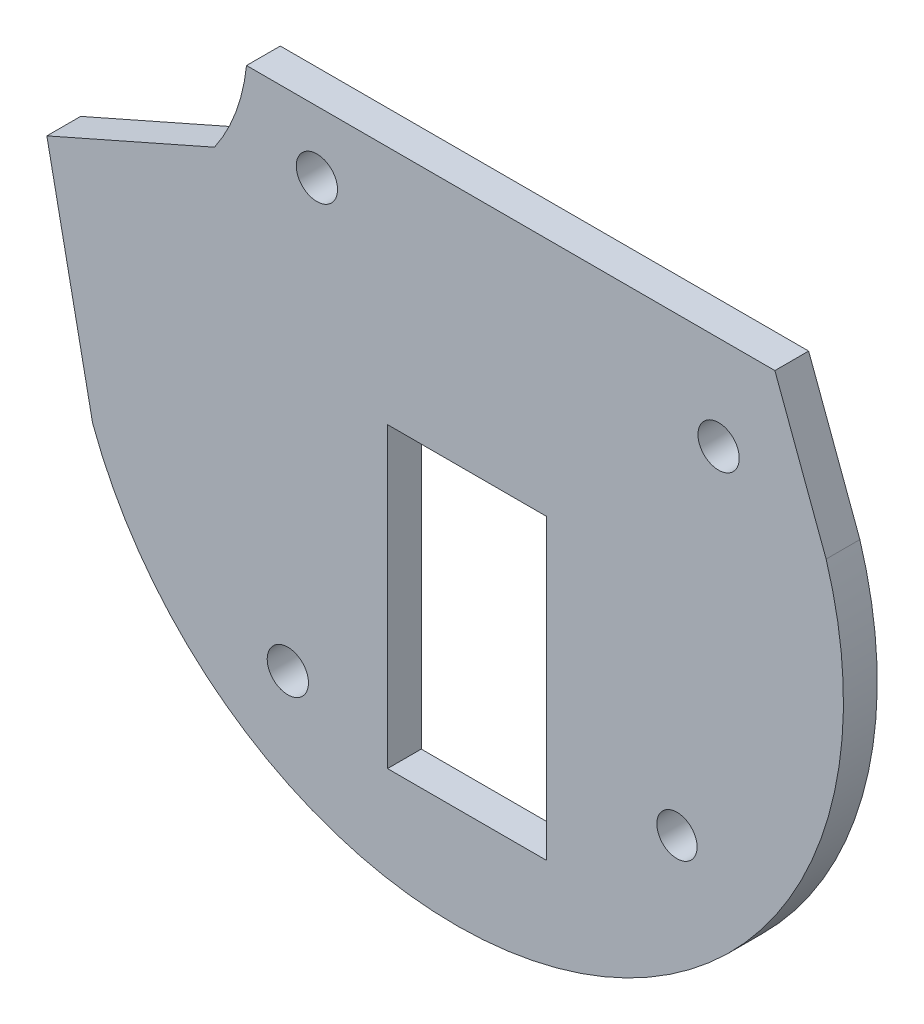
ISO-10303-21;
HEADER;
FILE_DESCRIPTION(('STEP AP214'),'2;1');
FILE_NAME('part.step','',(''),(''),'','','');
FILE_SCHEMA(('AUTOMOTIVE_DESIGN { 1 0 10303 214 1 1 1 1 }'));
ENDSEC;
DATA;
#1=APPLICATION_CONTEXT('core data for automotive mechanical design processes');
#2=APPLICATION_PROTOCOL_DEFINITION('international standard','automotive_design',2000,#1);
#3=PRODUCT_CONTEXT('',#1,'mechanical');
#4=PRODUCT('Part','Part','',(#3));
#5=PRODUCT_RELATED_PRODUCT_CATEGORY('part','',(#4));
#6=PRODUCT_DEFINITION_FORMATION('','',#4);
#7=PRODUCT_DEFINITION_CONTEXT('part definition',#1,'design');
#8=PRODUCT_DEFINITION('design','',#6,#7);
#9=PRODUCT_DEFINITION_SHAPE('','',#8);
#10=(LENGTH_UNIT() NAMED_UNIT(*) SI_UNIT(.MILLI.,.METRE.));
#11=(NAMED_UNIT(*) PLANE_ANGLE_UNIT() SI_UNIT($,.RADIAN.));
#12=(NAMED_UNIT(*) SI_UNIT($,.STERADIAN.) SOLID_ANGLE_UNIT());
#13=UNCERTAINTY_MEASURE_WITH_UNIT(LENGTH_MEASURE(1.E-05),#10,'distance_accuracy_value','');
#14=(GEOMETRIC_REPRESENTATION_CONTEXT(3) GLOBAL_UNCERTAINTY_ASSIGNED_CONTEXT((#13)) GLOBAL_UNIT_ASSIGNED_CONTEXT((#10,
#11,#12)) REPRESENTATION_CONTEXT('',''));
#15=CARTESIAN_POINT('',(0.,0.,0.));
#16=DIRECTION('',(0.,0.,1.));
#17=DIRECTION('',(1.,0.,0.));
#18=AXIS2_PLACEMENT_3D('',#15,#16,#17);
#19=CARTESIAN_POINT('',(3.9740812322332,17.199431679907,-2.286));
#20=DIRECTION('',(0.,0.,-1.));
#21=DIRECTION('',(-1.,0.,0.));
#22=AXIS2_PLACEMENT_3D('',#19,#20,#21);
#23=PLANE('',#22);
#24=DIRECTION('',(0.,1.,0.));
#25=VECTOR('',#24,1.);
#26=CARTESIAN_POINT('',(-0.664924943618999,-2.16687054231655,-2.286));
#27=LINE('',#26,#25);
#28=CARTESIAN_POINT('',(-0.664924943618999,-2.16687054231655,-2.286));
#29=VERTEX_POINT('',#28);
#30=CARTESIAN_POINT('',(-0.664924943618993,18.0007294576834,-2.286));
#31=VERTEX_POINT('',#30);
#32=EDGE_CURVE('E47',#29,#31,#27,.T.);
#33=ORIENTED_EDGE('',*,*,#32,.F.);
#34=DIRECTION('',(-1.,0.,0.));
#35=VECTOR('',#34,1.);
#36=CARTESIAN_POINT('',(10.104675056381,-2.16687054231655,-2.286));
#37=LINE('',#36,#35);
#38=CARTESIAN_POINT('',(10.104675056381,-2.16687054231655,-2.286));
#39=VERTEX_POINT('',#38);
#40=EDGE_CURVE('E127',#39,#29,#37,.T.);
#41=ORIENTED_EDGE('',*,*,#40,.F.);
#42=DIRECTION('',(0.,-1.,0.));
#43=VECTOR('',#42,1.);
#44=CARTESIAN_POINT('',(10.104675056381,-2.16687054231655,-2.286));
#45=LINE('',#44,#43);
#46=CARTESIAN_POINT('',(10.104675056381,18.0007294576834,-2.286));
#47=VERTEX_POINT('',#46);
#48=EDGE_CURVE('E112',#47,#39,#45,.T.);
#49=ORIENTED_EDGE('',*,*,#48,.F.);
#50=DIRECTION('',(1.,0.,0.));
#51=VECTOR('',#50,1.);
#52=CARTESIAN_POINT('',(10.104675056381,18.0007294576834,-2.286));
#53=LINE('',#52,#51);
#54=EDGE_CURVE('E121',#31,#47,#53,.T.);
#55=ORIENTED_EDGE('',*,*,#54,.F.);
#56=EDGE_LOOP('',(#33,#41,#49,#55));
#57=FACE_BOUND('',#56,.T.);
#58=CARTESIAN_POINT('',(18.9310412725264,3.71163363169514,-2.286));
#59=DIRECTION('',(0.,0.,-1.));
#60=DIRECTION('',(-1.,0.,0.));
#61=AXIS2_PLACEMENT_3D('',#58,#59,#60);
#62=CIRCLE('',#61,1.36221903365474);
#63=CARTESIAN_POINT('',(17.5688222388716,3.71163363169514,-2.286));
#64=VERTEX_POINT('',#63);
#65=EDGE_CURVE('E146',#64,#64,#62,.T.);
#66=ORIENTED_EDGE('',*,*,#65,.F.);
#67=EDGE_LOOP('',(#66));
#68=FACE_BOUND('',#67,.T.);
#69=CARTESIAN_POINT('',(21.7505816204853,27.9321294603715,-2.286));
#70=DIRECTION('',(0.,0.,-1.));
#71=DIRECTION('',(-1.,0.,0.));
#72=AXIS2_PLACEMENT_3D('',#69,#70,#71);
#73=CIRCLE('',#72,1.39700000000144);
#74=CARTESIAN_POINT('',(20.3535816204838,27.9321294603715,-2.286));
#75=VERTEX_POINT('',#74);
#76=EDGE_CURVE('E158',#75,#75,#73,.T.);
#77=ORIENTED_EDGE('',*,*,#76,.F.);
#78=EDGE_LOOP('',(#77));
#79=FACE_BOUND('',#78,.T.);
#80=DIRECTION('',(0.34877796767638,-0.937205382647547,0.));
#81=VECTOR('',#80,1.);
#82=CARTESIAN_POINT('',(25.5605816199512,34.2821294606921,-2.286));
#83=LINE('',#82,#81);
#84=CARTESIAN_POINT('',(25.5605816199512,34.2821294606921,-2.286));
#85=VERTEX_POINT('',#84);
#86=CARTESIAN_POINT('',(29.0285403943555,24.9633366142721,-2.286));
#87=VERTEX_POINT('',#86);
#88=EDGE_CURVE('E164',#85,#87,#83,.T.);
#89=ORIENTED_EDGE('',*,*,#88,.T.);
#90=CARTESIAN_POINT('',(3.9740812322332,17.199431679907,-2.286));
#91=DIRECTION('',(0.,0.,-1.));
#92=DIRECTION('',(-1.,0.,0.));
#93=AXIS2_PLACEMENT_3D('',#90,#91,#92);
#94=CIRCLE('',#93,26.229833086322);
#95=CARTESIAN_POINT('',(-20.6299682712623,8.10850808734212,-2.286));
#96=VERTEX_POINT('',#95);
#97=EDGE_CURVE('E167',#87,#96,#94,.T.);
#98=ORIENTED_EDGE('',*,*,#97,.T.);
#99=DIRECTION('',(-0.198505284294286,0.980099817420269,0.));
#100=VECTOR('',#99,1.);
#101=CARTESIAN_POINT('',(-23.7266606110478,23.3981141430225,-2.286));
#102=LINE('',#101,#100);
#103=CARTESIAN_POINT('',(-23.7266606110478,23.3981141430225,-2.286));
#104=VERTEX_POINT('',#103);
#105=EDGE_CURVE('E170',#96,#104,#102,.T.);
#106=ORIENTED_EDGE('',*,*,#105,.T.);
#107=DIRECTION('',(0.914846758610003,0.403801198934291,0.));
#108=VECTOR('',#107,1.);
#109=CARTESIAN_POINT('',(-12.3774095044088,28.4075227251005,-2.286));
#110=LINE('',#109,#108);
#111=CARTESIAN_POINT('',(-12.3774095044088,28.4075227251005,-2.286));
#112=VERTEX_POINT('',#111);
#113=EDGE_CURVE('E172',#104,#112,#110,.T.);
#114=ORIENTED_EDGE('',*,*,#113,.T.);
#115=CARTESIAN_POINT('',(-22.7937575549379,35.5888082569436,-2.286));
#116=DIRECTION('',(0.,0.,1.));
#117=DIRECTION('',(-1.,0.,0.));
#118=AXIS2_PLACEMENT_3D('',#115,#116,#117);
#119=CIRCLE('',#118,12.6519235138227);
#120=CARTESIAN_POINT('',(-10.209491222919,34.2821294576834,-2.286));
#121=VERTEX_POINT('',#120);
#122=EDGE_CURVE('E174',#112,#121,#119,.T.);
#123=ORIENTED_EDGE('',*,*,#122,.T.);
#124=DIRECTION('',(1.,8.41111723922713E-11,0.));
#125=VECTOR('',#124,1.);
#126=CARTESIAN_POINT('',(25.5605816199512,34.2821294606921,-2.286));
#127=LINE('',#126,#125);
#128=EDGE_CURVE('E176',#121,#85,#127,.T.);
#129=ORIENTED_EDGE('',*,*,#128,.T.);
#130=EDGE_LOOP('',(#89,#98,#106,#114,#123,#129));
#131=FACE_BOUND('',#130,.T.);
#132=CARTESIAN_POINT('',(-5.44454065001504,30.0847795749855,-2.286));
#133=DIRECTION('',(0.,0.,-1.));
#134=DIRECTION('',(-1.,0.,0.));
#135=AXIS2_PLACEMENT_3D('',#132,#133,#134);
#136=CIRCLE('',#135,1.39700000000141);
#137=CARTESIAN_POINT('',(-6.84154065001644,30.0847795749855,-2.286));
#138=VERTEX_POINT('',#137);
#139=EDGE_CURVE('E152',#138,#138,#136,.T.);
#140=ORIENTED_EDGE('',*,*,#139,.F.);
#141=EDGE_LOOP('',(#140));
#142=FACE_BOUND('',#141,.T.);
#143=CARTESIAN_POINT('',(-7.41242768109301,0.181665370216247,-2.286));
#144=DIRECTION('',(0.,0.,-1.));
#145=DIRECTION('',(-1.,0.,0.));
#146=AXIS2_PLACEMENT_3D('',#143,#144,#145);
#147=CIRCLE('',#146,1.3970000000008);
#148=CARTESIAN_POINT('',(-8.80942768109382,0.181665370216247,-2.286));
#149=VERTEX_POINT('',#148);
#150=EDGE_CURVE('E140',#149,#149,#147,.T.);
#151=ORIENTED_EDGE('',*,*,#150,.F.);
#152=EDGE_LOOP('',(#151));
#153=FACE_BOUND('',#152,.T.);
#154=ADVANCED_FACE('F32',(#57,#68,#79,#131,#142,#153),#23,.T.);
#155=CARTESIAN_POINT('',(3.9740812322332,17.199431679907,0.));
#156=DIRECTION('',(0.,0.,-1.));
#157=DIRECTION('',(-1.,0.,0.));
#158=AXIS2_PLACEMENT_3D('',#155,#156,#157);
#159=PLANE('',#158);
#160=DIRECTION('',(1.,0.,0.));
#161=VECTOR('',#160,1.);
#162=CARTESIAN_POINT('',(10.104675056381,-2.16687054231655,0.));
#163=LINE('',#162,#161);
#164=CARTESIAN_POINT('',(-0.664924943619,-2.16687054231655,0.));
#165=VERTEX_POINT('',#164);
#166=CARTESIAN_POINT('',(10.104675056381,-2.16687054231655,0.));
#167=VERTEX_POINT('',#166);
#168=EDGE_CURVE('E277',#165,#167,#163,.T.);
#169=ORIENTED_EDGE('',*,*,#168,.F.);
#170=DIRECTION('',(0.,-1.,0.));
#171=VECTOR('',#170,1.);
#172=CARTESIAN_POINT('',(-0.664924943618999,-2.16687054231655,0.));
#173=LINE('',#172,#171);
#174=CARTESIAN_POINT('',(-0.664924943618993,18.0007294576834,0.));
#175=VERTEX_POINT('',#174);
#176=EDGE_CURVE('E139',#175,#165,#173,.T.);
#177=ORIENTED_EDGE('',*,*,#176,.F.);
#178=DIRECTION('',(-1.,0.,0.));
#179=VECTOR('',#178,1.);
#180=CARTESIAN_POINT('',(10.104675056381,18.0007294576834,0.));
#181=LINE('',#180,#179);
#182=CARTESIAN_POINT('',(10.104675056381,18.0007294576834,0.));
#183=VERTEX_POINT('',#182);
#184=EDGE_CURVE('E136',#183,#175,#181,.T.);
#185=ORIENTED_EDGE('',*,*,#184,.F.);
#186=DIRECTION('',(0.,1.,0.));
#187=VECTOR('',#186,1.);
#188=CARTESIAN_POINT('',(10.104675056381,-2.16687054231655,0.));
#189=LINE('',#188,#187);
#190=EDGE_CURVE('E115',#167,#183,#189,.T.);
#191=ORIENTED_EDGE('',*,*,#190,.F.);
#192=EDGE_LOOP('',(#169,#177,#185,#191));
#193=FACE_BOUND('',#192,.T.);
#194=CARTESIAN_POINT('',(18.9310412725264,3.71163363169514,0.));
#195=DIRECTION('',(0.,0.,-1.));
#196=DIRECTION('',(-1.,0.,0.));
#197=AXIS2_PLACEMENT_3D('',#194,#195,#196);
#198=CIRCLE('',#197,1.36221903365474);
#199=CARTESIAN_POINT('',(17.5688222388716,3.71163363169514,0.));
#200=VERTEX_POINT('',#199);
#201=EDGE_CURVE('E143',#200,#200,#198,.T.);
#202=ORIENTED_EDGE('',*,*,#201,.T.);
#203=EDGE_LOOP('',(#202));
#204=FACE_BOUND('',#203,.T.);
#205=CARTESIAN_POINT('',(21.7505816204853,27.9321294603715,0.));
#206=DIRECTION('',(0.,0.,-1.));
#207=DIRECTION('',(-1.,0.,0.));
#208=AXIS2_PLACEMENT_3D('',#205,#206,#207);
#209=CIRCLE('',#208,1.39700000000144);
#210=CARTESIAN_POINT('',(20.3535816204838,27.9321294603715,0.));
#211=VERTEX_POINT('',#210);
#212=EDGE_CURVE('E155',#211,#211,#209,.T.);
#213=ORIENTED_EDGE('',*,*,#212,.T.);
#214=EDGE_LOOP('',(#213));
#215=FACE_BOUND('',#214,.T.);
#216=DIRECTION('',(0.34877796767638,-0.937205382647547,0.));
#217=VECTOR('',#216,1.);
#218=CARTESIAN_POINT('',(25.5605816199512,34.2821294606921,0.));
#219=LINE('',#218,#217);
#220=CARTESIAN_POINT('',(25.5605816199512,34.2821294606921,0.));
#221=VERTEX_POINT('',#220);
#222=CARTESIAN_POINT('',(29.0285403943555,24.9633366142721,0.));
#223=VERTEX_POINT('',#222);
#224=EDGE_CURVE('E161',#221,#223,#219,.T.);
#225=ORIENTED_EDGE('',*,*,#224,.F.);
#226=DIRECTION('',(1.,8.41111723922713E-11,0.));
#227=VECTOR('',#226,1.);
#228=CARTESIAN_POINT('',(25.5605816199512,34.2821294606921,0.));
#229=LINE('',#228,#227);
#230=CARTESIAN_POINT('',(-10.209491222919,34.2821294576834,0.));
#231=VERTEX_POINT('',#230);
#232=EDGE_CURVE('E168',#231,#221,#229,.T.);
#233=ORIENTED_EDGE('',*,*,#232,.F.);
#234=CARTESIAN_POINT('',(-22.7937575549379,35.5888082569436,0.));
#235=DIRECTION('',(0.,0.,1.));
#236=DIRECTION('',(-1.,0.,0.));
#237=AXIS2_PLACEMENT_3D('',#234,#235,#236);
#238=CIRCLE('',#237,12.6519235138227);
#239=CARTESIAN_POINT('',(-12.3774095044088,28.4075227251005,0.));
#240=VERTEX_POINT('',#239);
#241=EDGE_CURVE('E187',#240,#231,#238,.T.);
#242=ORIENTED_EDGE('',*,*,#241,.F.);
#243=DIRECTION('',(0.914846758610003,0.403801198934291,0.));
#244=VECTOR('',#243,1.);
#245=CARTESIAN_POINT('',(-12.3774095044088,28.4075227251005,0.));
#246=LINE('',#245,#244);
#247=CARTESIAN_POINT('',(-23.7266606110478,23.3981141430225,0.));
#248=VERTEX_POINT('',#247);
#249=EDGE_CURVE('E185',#248,#240,#246,.T.);
#250=ORIENTED_EDGE('',*,*,#249,.F.);
#251=DIRECTION('',(-0.198505284294286,0.980099817420269,0.));
#252=VECTOR('',#251,1.);
#253=CARTESIAN_POINT('',(-23.7266606110478,23.3981141430225,0.));
#254=LINE('',#253,#252);
#255=CARTESIAN_POINT('',(-20.6299682712623,8.10850808734212,0.));
#256=VERTEX_POINT('',#255);
#257=EDGE_CURVE('E183',#256,#248,#254,.T.);
#258=ORIENTED_EDGE('',*,*,#257,.F.);
#259=CARTESIAN_POINT('',(3.9740812322332,17.199431679907,0.));
#260=DIRECTION('',(0.,0.,-1.));
#261=DIRECTION('',(-1.,0.,0.));
#262=AXIS2_PLACEMENT_3D('',#259,#260,#261);
#263=CIRCLE('',#262,26.229833086322);
#264=EDGE_CURVE('E181',#223,#256,#263,.T.);
#265=ORIENTED_EDGE('',*,*,#264,.F.);
#266=EDGE_LOOP('',(#225,#233,#242,#250,#258,#265));
#267=FACE_BOUND('',#266,.T.);
#268=CARTESIAN_POINT('',(-5.44454065001504,30.0847795749855,0.));
#269=DIRECTION('',(0.,0.,-1.));
#270=DIRECTION('',(-1.,0.,0.));
#271=AXIS2_PLACEMENT_3D('',#268,#269,#270);
#272=CIRCLE('',#271,1.39700000000141);
#273=CARTESIAN_POINT('',(-6.84154065001644,30.0847795749855,0.));
#274=VERTEX_POINT('',#273);
#275=EDGE_CURVE('E149',#274,#274,#272,.T.);
#276=ORIENTED_EDGE('',*,*,#275,.T.);
#277=EDGE_LOOP('',(#276));
#278=FACE_BOUND('',#277,.T.);
#279=CARTESIAN_POINT('',(-7.41242768109301,0.181665370216247,0.));
#280=DIRECTION('',(0.,0.,-1.));
#281=DIRECTION('',(-1.,0.,0.));
#282=AXIS2_PLACEMENT_3D('',#279,#280,#281);
#283=CIRCLE('',#282,1.3970000000008);
#284=CARTESIAN_POINT('',(-8.80942768109382,0.181665370216247,0.));
#285=VERTEX_POINT('',#284);
#286=EDGE_CURVE('E138',#285,#285,#283,.T.);
#287=ORIENTED_EDGE('',*,*,#286,.T.);
#288=EDGE_LOOP('',(#287));
#289=FACE_BOUND('',#288,.T.);
#290=ADVANCED_FACE('F211',(#193,#204,#215,#267,#278,#289),#159,.F.);
#291=CARTESIAN_POINT('',(25.5605816199512,34.2821294606921,-2.286));
#292=DIRECTION('',(-0.937205382647546,-0.34877796767638,0.));
#293=DIRECTION('',(0.34877796767638,-0.937205382647547,0.));
#294=AXIS2_PLACEMENT_3D('',#291,#292,#293);
#295=PLANE('',#294);
#296=ORIENTED_EDGE('',*,*,#224,.T.);
#297=DIRECTION('',(0.,0.,1.));
#298=VECTOR('',#297,1.);
#299=CARTESIAN_POINT('',(29.0285403943555,24.9633366142721,-2.286));
#300=LINE('',#299,#298);
#301=EDGE_CURVE('E11',#87,#223,#300,.T.);
#302=ORIENTED_EDGE('',*,*,#301,.F.);
#303=ORIENTED_EDGE('',*,*,#88,.F.);
#304=DIRECTION('',(0.,0.,1.));
#305=VECTOR('',#304,1.);
#306=CARTESIAN_POINT('',(25.5605816199512,34.2821294606921,-2.286));
#307=LINE('',#306,#305);
#308=EDGE_CURVE('E178',#85,#221,#307,.T.);
#309=ORIENTED_EDGE('',*,*,#308,.T.);
#310=EDGE_LOOP('',(#296,#302,#303,#309));
#311=FACE_BOUND('',#310,.T.);
#312=ADVANCED_FACE('F34',(#311),#295,.F.);
#313=CARTESIAN_POINT('',(3.9740812322332,17.199431679907,-2.286));
#314=DIRECTION('',(0.,0.,1.));
#315=DIRECTION('',(1.,0.,0.));
#316=AXIS2_PLACEMENT_3D('',#313,#314,#315);
#317=CYLINDRICAL_SURFACE('',#316,26.229833086322);
#318=ORIENTED_EDGE('',*,*,#264,.T.);
#319=DIRECTION('',(0.,0.,1.));
#320=VECTOR('',#319,1.);
#321=CARTESIAN_POINT('',(-20.6299682712623,8.10850808734212,-2.286));
#322=LINE('',#321,#320);
#323=EDGE_CURVE('E40',#96,#256,#322,.T.);
#324=ORIENTED_EDGE('',*,*,#323,.F.);
#325=ORIENTED_EDGE('',*,*,#97,.F.);
#326=ORIENTED_EDGE('',*,*,#301,.T.);
#327=EDGE_LOOP('',(#318,#324,#325,#326));
#328=FACE_BOUND('',#327,.T.);
#329=ADVANCED_FACE('F229',(#328),#317,.T.);
#330=CARTESIAN_POINT('',(-23.7266606110478,23.3981141430225,-2.286));
#331=DIRECTION('',(0.980099817420269,0.198505284294286,0.));
#332=DIRECTION('',(-0.198505284294286,0.980099817420269,0.));
#333=AXIS2_PLACEMENT_3D('',#330,#331,#332);
#334=PLANE('',#333);
#335=ORIENTED_EDGE('',*,*,#257,.T.);
#336=DIRECTION('',(0.,0.,1.));
#337=VECTOR('',#336,1.);
#338=CARTESIAN_POINT('',(-23.7266606110478,23.3981141430225,-2.286));
#339=LINE('',#338,#337);
#340=EDGE_CURVE('E198',#104,#248,#339,.T.);
#341=ORIENTED_EDGE('',*,*,#340,.F.);
#342=ORIENTED_EDGE('',*,*,#105,.F.);
#343=ORIENTED_EDGE('',*,*,#323,.T.);
#344=EDGE_LOOP('',(#335,#341,#342,#343));
#345=FACE_BOUND('',#344,.T.);
#346=ADVANCED_FACE('F205',(#345),#334,.F.);
#347=CARTESIAN_POINT('',(-12.3774095044088,28.4075227251005,-2.286));
#348=DIRECTION('',(0.403801198934291,-0.914846758610003,0.));
#349=DIRECTION('',(0.914846758610003,0.403801198934291,0.));
#350=AXIS2_PLACEMENT_3D('',#347,#348,#349);
#351=PLANE('',#350);
#352=ORIENTED_EDGE('',*,*,#249,.T.);
#353=DIRECTION('',(0.,0.,1.));
#354=VECTOR('',#353,1.);
#355=CARTESIAN_POINT('',(-12.3774095044088,28.4075227251005,-2.286));
#356=LINE('',#355,#354);
#357=EDGE_CURVE('E195',#112,#240,#356,.T.);
#358=ORIENTED_EDGE('',*,*,#357,.F.);
#359=ORIENTED_EDGE('',*,*,#113,.F.);
#360=ORIENTED_EDGE('',*,*,#340,.T.);
#361=EDGE_LOOP('',(#352,#358,#359,#360));
#362=FACE_BOUND('',#361,.T.);
#363=ADVANCED_FACE('F217',(#362),#351,.F.);
#364=CARTESIAN_POINT('',(-22.7937575549379,35.5888082569436,-2.286));
#365=DIRECTION('',(0.,0.,1.));
#366=DIRECTION('',(1.,0.,0.));
#367=AXIS2_PLACEMENT_3D('',#364,#365,#366);
#368=CYLINDRICAL_SURFACE('',#367,12.6519235138227);
#369=ORIENTED_EDGE('',*,*,#241,.T.);
#370=DIRECTION('',(0.,0.,1.));
#371=VECTOR('',#370,1.);
#372=CARTESIAN_POINT('',(-10.209491222919,34.2821294576834,-2.286));
#373=LINE('',#372,#371);
#374=EDGE_CURVE('E192',#121,#231,#373,.T.);
#375=ORIENTED_EDGE('',*,*,#374,.F.);
#376=ORIENTED_EDGE('',*,*,#122,.F.);
#377=ORIENTED_EDGE('',*,*,#357,.T.);
#378=EDGE_LOOP('',(#369,#375,#376,#377));
#379=FACE_BOUND('',#378,.T.);
#380=ADVANCED_FACE('F221',(#379),#368,.F.);
#381=CARTESIAN_POINT('',(25.5605816199512,34.2821294606921,-2.286));
#382=DIRECTION('',(8.41111723922713E-11,-1.,0.));
#383=DIRECTION('',(1.,8.41111723922713E-11,0.));
#384=AXIS2_PLACEMENT_3D('',#381,#382,#383);
#385=PLANE('',#384);
#386=ORIENTED_EDGE('',*,*,#232,.T.);
#387=ORIENTED_EDGE('',*,*,#308,.F.);
#388=ORIENTED_EDGE('',*,*,#128,.F.);
#389=ORIENTED_EDGE('',*,*,#374,.T.);
#390=EDGE_LOOP('',(#386,#387,#388,#389));
#391=FACE_BOUND('',#390,.T.);
#392=ADVANCED_FACE('F232',(#391),#385,.F.);
#393=CARTESIAN_POINT('',(21.7505816204853,27.9321294603715,-2.286));
#394=DIRECTION('',(0.,0.,1.));
#395=DIRECTION('',(1.,0.,0.));
#396=AXIS2_PLACEMENT_3D('',#393,#394,#395);
#397=CYLINDRICAL_SURFACE('',#396,1.39700000000144);
#398=ORIENTED_EDGE('',*,*,#76,.T.);
#399=EDGE_LOOP('',(#398));
#400=FACE_BOUND('',#399,.T.);
#401=ORIENTED_EDGE('',*,*,#212,.F.);
#402=EDGE_LOOP('',(#401));
#403=FACE_BOUND('',#402,.T.);
#404=ADVANCED_FACE('F234',(#400,#403),#397,.F.);
#405=CARTESIAN_POINT('',(-5.44454065001504,30.0847795749855,-2.286));
#406=DIRECTION('',(0.,0.,1.));
#407=DIRECTION('',(1.,0.,0.));
#408=AXIS2_PLACEMENT_3D('',#405,#406,#407);
#409=CYLINDRICAL_SURFACE('',#408,1.39700000000141);
#410=ORIENTED_EDGE('',*,*,#139,.T.);
#411=EDGE_LOOP('',(#410));
#412=FACE_BOUND('',#411,.T.);
#413=ORIENTED_EDGE('',*,*,#275,.F.);
#414=EDGE_LOOP('',(#413));
#415=FACE_BOUND('',#414,.T.);
#416=ADVANCED_FACE('F240',(#412,#415),#409,.F.);
#417=CARTESIAN_POINT('',(18.9310412725264,3.71163363169514,-2.286));
#418=DIRECTION('',(0.,0.,1.));
#419=DIRECTION('',(1.,0.,0.));
#420=AXIS2_PLACEMENT_3D('',#417,#418,#419);
#421=CYLINDRICAL_SURFACE('',#420,1.36221903365474);
#422=ORIENTED_EDGE('',*,*,#65,.T.);
#423=EDGE_LOOP('',(#422));
#424=FACE_BOUND('',#423,.T.);
#425=ORIENTED_EDGE('',*,*,#201,.F.);
#426=EDGE_LOOP('',(#425));
#427=FACE_BOUND('',#426,.T.);
#428=ADVANCED_FACE('F254',(#424,#427),#421,.F.);
#429=CARTESIAN_POINT('',(-7.41242768109301,0.181665370216247,-2.286));
#430=DIRECTION('',(0.,0.,1.));
#431=DIRECTION('',(1.,0.,0.));
#432=AXIS2_PLACEMENT_3D('',#429,#430,#431);
#433=CYLINDRICAL_SURFACE('',#432,1.3970000000008);
#434=ORIENTED_EDGE('',*,*,#150,.T.);
#435=EDGE_LOOP('',(#434));
#436=FACE_BOUND('',#435,.T.);
#437=ORIENTED_EDGE('',*,*,#286,.F.);
#438=EDGE_LOOP('',(#437));
#439=FACE_BOUND('',#438,.T.);
#440=ADVANCED_FACE('F258',(#436,#439),#433,.F.);
#441=CARTESIAN_POINT('',(-0.664924943618999,-2.16687054231655,22.8629913598374));
#442=DIRECTION('',(-1.,0.,0.));
#443=DIRECTION('',(0.,-1.,0.));
#444=AXIS2_PLACEMENT_3D('',#441,#442,#443);
#445=PLANE('',#444);
#446=ORIENTED_EDGE('',*,*,#176,.T.);
#447=DIRECTION('',(0.,0.,-1.));
#448=VECTOR('',#447,1.);
#449=CARTESIAN_POINT('',(-0.664924943618999,-2.16687054231655,22.8629913598374));
#450=LINE('',#449,#448);
#451=EDGE_CURVE('E132',#165,#29,#450,.T.);
#452=ORIENTED_EDGE('',*,*,#451,.T.);
#453=ORIENTED_EDGE('',*,*,#32,.T.);
#454=DIRECTION('',(0.,0.,-1.));
#455=VECTOR('',#454,1.);
#456=CARTESIAN_POINT('',(-0.664924943618993,18.0007294576834,22.8629913598374));
#457=LINE('',#456,#455);
#458=EDGE_CURVE('E118',#175,#31,#457,.T.);
#459=ORIENTED_EDGE('',*,*,#458,.F.);
#460=EDGE_LOOP('',(#446,#452,#453,#459));
#461=FACE_BOUND('',#460,.T.);
#462=ADVANCED_FACE('F262',(#461),#445,.F.);
#463=CARTESIAN_POINT('',(10.104675056381,-2.16687054231655,22.8629913598374));
#464=DIRECTION('',(0.,-1.,0.));
#465=DIRECTION('',(1.,0.,0.));
#466=AXIS2_PLACEMENT_3D('',#463,#464,#465);
#467=PLANE('',#466);
#468=ORIENTED_EDGE('',*,*,#168,.T.);
#469=DIRECTION('',(0.,0.,-1.));
#470=VECTOR('',#469,1.);
#471=CARTESIAN_POINT('',(10.104675056381,-2.16687054231655,22.8629913598374));
#472=LINE('',#471,#470);
#473=EDGE_CURVE('E117',#167,#39,#472,.T.);
#474=ORIENTED_EDGE('',*,*,#473,.T.);
#475=ORIENTED_EDGE('',*,*,#40,.T.);
#476=ORIENTED_EDGE('',*,*,#451,.F.);
#477=EDGE_LOOP('',(#468,#474,#475,#476));
#478=FACE_BOUND('',#477,.T.);
#479=ADVANCED_FACE('F266',(#478),#467,.F.);
#480=CARTESIAN_POINT('',(10.104675056381,-2.16687054231655,22.8629913598374));
#481=DIRECTION('',(1.,0.,0.));
#482=DIRECTION('',(0.,1.,0.));
#483=AXIS2_PLACEMENT_3D('',#480,#481,#482);
#484=PLANE('',#483);
#485=ORIENTED_EDGE('',*,*,#190,.T.);
#486=DIRECTION('',(0.,0.,-1.));
#487=VECTOR('',#486,1.);
#488=CARTESIAN_POINT('',(10.104675056381,18.0007294576834,22.8629913598374));
#489=LINE('',#488,#487);
#490=EDGE_CURVE('E55',#183,#47,#489,.T.);
#491=ORIENTED_EDGE('',*,*,#490,.T.);
#492=ORIENTED_EDGE('',*,*,#48,.T.);
#493=ORIENTED_EDGE('',*,*,#473,.F.);
#494=EDGE_LOOP('',(#485,#491,#492,#493));
#495=FACE_BOUND('',#494,.T.);
#496=ADVANCED_FACE('F109',(#495),#484,.F.);
#497=CARTESIAN_POINT('',(10.104675056381,18.0007294576834,22.8629913598374));
#498=DIRECTION('',(0.,1.,0.));
#499=DIRECTION('',(0.,0.,1.));
#500=AXIS2_PLACEMENT_3D('',#497,#498,#499);
#501=PLANE('',#500);
#502=ORIENTED_EDGE('',*,*,#184,.T.);
#503=ORIENTED_EDGE('',*,*,#458,.T.);
#504=ORIENTED_EDGE('',*,*,#54,.T.);
#505=ORIENTED_EDGE('',*,*,#490,.F.);
#506=EDGE_LOOP('',(#502,#503,#504,#505));
#507=FACE_BOUND('',#506,.T.);
#508=ADVANCED_FACE('F122',(#507),#501,.F.);
#509=CLOSED_SHELL('',(#154,#290,#312,#329,#346,#363,#380,#392,#404,#416,#428,#440,#462,#479,
#496,#508));
#510=MANIFOLD_SOLID_BREP('B2',#509);
#511=ADVANCED_BREP_SHAPE_REPRESENTATION('',(#18,#510),#14);
#512=SHAPE_DEFINITION_REPRESENTATION(#9,#511);
ENDSEC;
END-ISO-10303-21;
